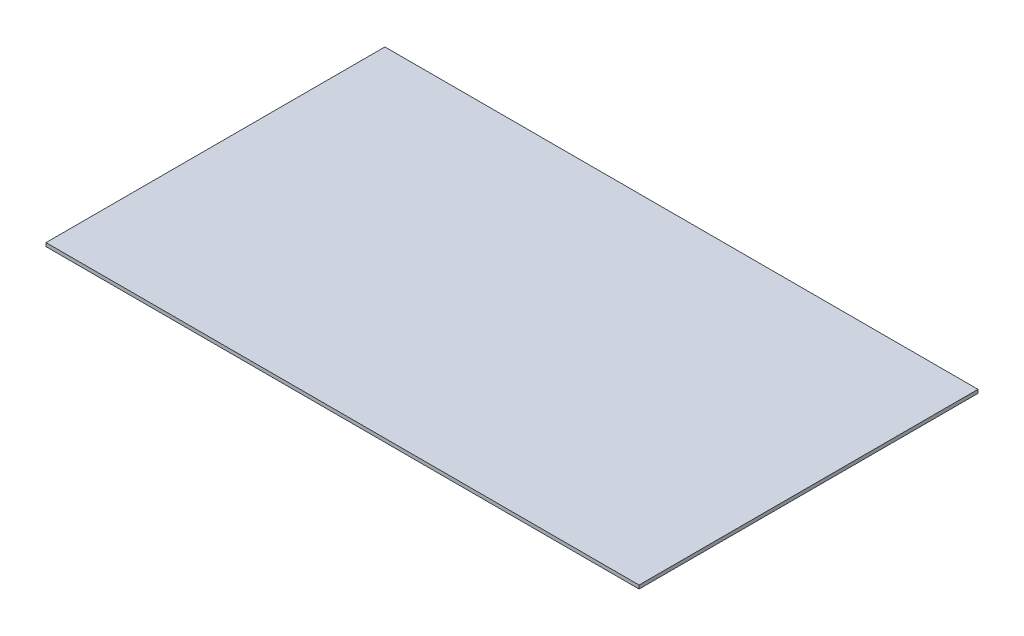
ISO-10303-21;
HEADER;
FILE_DESCRIPTION(('STEP AP214'),'2;1');
FILE_NAME('part.step','',(''),(''),'','','');
FILE_SCHEMA(('AUTOMOTIVE_DESIGN { 1 0 10303 214 1 1 1 1 }'));
ENDSEC;
DATA;
#1=APPLICATION_CONTEXT('core data for automotive mechanical design processes');
#2=APPLICATION_PROTOCOL_DEFINITION('international standard','automotive_design',2000,#1);
#3=PRODUCT_CONTEXT('',#1,'mechanical');
#4=PRODUCT('Part','Part','',(#3));
#5=PRODUCT_RELATED_PRODUCT_CATEGORY('part','',(#4));
#6=PRODUCT_DEFINITION_FORMATION('','',#4);
#7=PRODUCT_DEFINITION_CONTEXT('part definition',#1,'design');
#8=PRODUCT_DEFINITION('design','',#6,#7);
#9=PRODUCT_DEFINITION_SHAPE('','',#8);
#10=(LENGTH_UNIT() NAMED_UNIT(*) SI_UNIT(.MILLI.,.METRE.));
#11=(NAMED_UNIT(*) PLANE_ANGLE_UNIT() SI_UNIT($,.RADIAN.));
#12=(NAMED_UNIT(*) SI_UNIT($,.STERADIAN.) SOLID_ANGLE_UNIT());
#13=UNCERTAINTY_MEASURE_WITH_UNIT(LENGTH_MEASURE(1.E-05),#10,'distance_accuracy_value','');
#14=(GEOMETRIC_REPRESENTATION_CONTEXT(3) GLOBAL_UNCERTAINTY_ASSIGNED_CONTEXT((#13)) GLOBAL_UNIT_ASSIGNED_CONTEXT((#10,
#11,#12)) REPRESENTATION_CONTEXT('',''));
#15=CARTESIAN_POINT('',(0.,0.,0.));
#16=DIRECTION('',(0.,0.,1.));
#17=DIRECTION('',(1.,0.,0.));
#18=AXIS2_PLACEMENT_3D('',#15,#16,#17);
#19=CARTESIAN_POINT('',(-1852.94392662048,-3.175,0.));
#20=DIRECTION('',(0.,0.,-1.));
#21=DIRECTION('',(-1.,0.,0.));
#22=AXIS2_PLACEMENT_3D('',#19,#20,#21);
#23=PLANE('',#22);
#24=DIRECTION('',(-1.,0.,0.));
#25=VECTOR('',#24,1.);
#26=CARTESIAN_POINT('',(-1852.94392662048,0.,0.));
#27=LINE('',#26,#25);
#28=CARTESIAN_POINT('',(-1586.24392662049,0.,0.));
#29=VERTEX_POINT('',#28);
#30=CARTESIAN_POINT('',(-2119.64392662049,0.,0.));
#31=VERTEX_POINT('',#30);
#32=EDGE_CURVE('E99',#29,#31,#27,.T.);
#33=ORIENTED_EDGE('',*,*,#32,.F.);
#34=DIRECTION('',(0.,1.,0.));
#35=VECTOR('',#34,1.);
#36=CARTESIAN_POINT('',(-1586.24392662049,-3.175,0.));
#37=LINE('',#36,#35);
#38=CARTESIAN_POINT('',(-1586.24392662049,-3.175,0.));
#39=VERTEX_POINT('',#38);
#40=EDGE_CURVE('E9',#39,#29,#37,.T.);
#41=ORIENTED_EDGE('',*,*,#40,.F.);
#42=DIRECTION('',(-1.,0.,0.));
#43=VECTOR('',#42,1.);
#44=CARTESIAN_POINT('',(-1852.94392662048,-3.175,0.));
#45=LINE('',#44,#43);
#46=CARTESIAN_POINT('',(-2119.64392662049,-3.175,0.));
#47=VERTEX_POINT('',#46);
#48=EDGE_CURVE('E77',#39,#47,#45,.T.);
#49=ORIENTED_EDGE('',*,*,#48,.T.);
#50=DIRECTION('',(0.,1.,0.));
#51=VECTOR('',#50,1.);
#52=CARTESIAN_POINT('',(-2119.64392662049,-3.175,0.));
#53=LINE('',#52,#51);
#54=EDGE_CURVE('E36',#47,#31,#53,.T.);
#55=ORIENTED_EDGE('',*,*,#54,.T.);
#56=EDGE_LOOP('',(#33,#41,#49,#55));
#57=FACE_BOUND('',#56,.T.);
#58=ADVANCED_FACE('F14',(#57),#23,.T.);
#59=CARTESIAN_POINT('',(-1586.24392662049,-3.175,152.4));
#60=DIRECTION('',(-1.,0.,0.));
#61=DIRECTION('',(0.,0.,1.));
#62=AXIS2_PLACEMENT_3D('',#59,#60,#61);
#63=PLANE('',#62);
#64=DIRECTION('',(0.,0.,1.));
#65=VECTOR('',#64,1.);
#66=CARTESIAN_POINT('',(-1586.24392662049,0.,152.4));
#67=LINE('',#66,#65);
#68=CARTESIAN_POINT('',(-1586.24392662049,0.,304.8));
#69=VERTEX_POINT('',#68);
#70=EDGE_CURVE('E84',#29,#69,#67,.T.);
#71=ORIENTED_EDGE('',*,*,#70,.T.);
#72=DIRECTION('',(0.,1.,0.));
#73=VECTOR('',#72,1.);
#74=CARTESIAN_POINT('',(-1586.24392662049,-3.175,304.8));
#75=LINE('',#74,#73);
#76=CARTESIAN_POINT('',(-1586.24392662049,-3.175,304.8));
#77=VERTEX_POINT('',#76);
#78=EDGE_CURVE('E23',#77,#69,#75,.T.);
#79=ORIENTED_EDGE('',*,*,#78,.F.);
#80=DIRECTION('',(0.,0.,1.));
#81=VECTOR('',#80,1.);
#82=CARTESIAN_POINT('',(-1586.24392662049,-3.175,152.4));
#83=LINE('',#82,#81);
#84=EDGE_CURVE('E71',#39,#77,#83,.T.);
#85=ORIENTED_EDGE('',*,*,#84,.F.);
#86=ORIENTED_EDGE('',*,*,#40,.T.);
#87=EDGE_LOOP('',(#71,#79,#85,#86));
#88=FACE_BOUND('',#87,.T.);
#89=ADVANCED_FACE('F82',(#88),#63,.F.);
#90=CARTESIAN_POINT('',(-1852.94392662048,-3.175,304.8));
#91=DIRECTION('',(0.,0.,-1.));
#92=DIRECTION('',(-1.,0.,0.));
#93=AXIS2_PLACEMENT_3D('',#90,#91,#92);
#94=PLANE('',#93);
#95=DIRECTION('',(-1.,0.,0.));
#96=VECTOR('',#95,1.);
#97=CARTESIAN_POINT('',(-1852.94392662048,0.,304.8));
#98=LINE('',#97,#96);
#99=CARTESIAN_POINT('',(-2119.64392662049,0.,304.8));
#100=VERTEX_POINT('',#99);
#101=EDGE_CURVE('E103',#69,#100,#98,.T.);
#102=ORIENTED_EDGE('',*,*,#101,.T.);
#103=DIRECTION('',(0.,1.,0.));
#104=VECTOR('',#103,1.);
#105=CARTESIAN_POINT('',(-2119.64392662049,-3.175,304.8));
#106=LINE('',#105,#104);
#107=CARTESIAN_POINT('',(-2119.64392662049,-3.175,304.8));
#108=VERTEX_POINT('',#107);
#109=EDGE_CURVE('E55',#108,#100,#106,.T.);
#110=ORIENTED_EDGE('',*,*,#109,.F.);
#111=DIRECTION('',(-1.,0.,0.));
#112=VECTOR('',#111,1.);
#113=CARTESIAN_POINT('',(-1852.94392662048,-3.175,304.8));
#114=LINE('',#113,#112);
#115=EDGE_CURVE('E76',#77,#108,#114,.T.);
#116=ORIENTED_EDGE('',*,*,#115,.F.);
#117=ORIENTED_EDGE('',*,*,#78,.T.);
#118=EDGE_LOOP('',(#102,#110,#116,#117));
#119=FACE_BOUND('',#118,.T.);
#120=ADVANCED_FACE('F88',(#119),#94,.F.);
#121=CARTESIAN_POINT('',(-2119.64392662049,-3.175,152.4));
#122=DIRECTION('',(-1.,0.,0.));
#123=DIRECTION('',(0.,0.,1.));
#124=AXIS2_PLACEMENT_3D('',#121,#122,#123);
#125=PLANE('',#124);
#126=DIRECTION('',(0.,0.,1.));
#127=VECTOR('',#126,1.);
#128=CARTESIAN_POINT('',(-2119.64392662049,0.,152.4));
#129=LINE('',#128,#127);
#130=EDGE_CURVE('E105',#31,#100,#129,.T.);
#131=ORIENTED_EDGE('',*,*,#130,.F.);
#132=ORIENTED_EDGE('',*,*,#54,.F.);
#133=DIRECTION('',(0.,0.,1.));
#134=VECTOR('',#133,1.);
#135=CARTESIAN_POINT('',(-2119.64392662049,-3.175,152.4));
#136=LINE('',#135,#134);
#137=EDGE_CURVE('E90',#47,#108,#136,.T.);
#138=ORIENTED_EDGE('',*,*,#137,.T.);
#139=ORIENTED_EDGE('',*,*,#109,.T.);
#140=EDGE_LOOP('',(#131,#132,#138,#139));
#141=FACE_BOUND('',#140,.T.);
#142=ADVANCED_FACE('F120',(#141),#125,.T.);
#143=CARTESIAN_POINT('',(-1852.94392662048,-3.175,152.4));
#144=DIRECTION('',(0.,-1.,0.));
#145=DIRECTION('',(1.,0.,0.));
#146=AXIS2_PLACEMENT_3D('',#143,#144,#145);
#147=PLANE('',#146);
#148=ORIENTED_EDGE('',*,*,#48,.F.);
#149=ORIENTED_EDGE('',*,*,#84,.T.);
#150=ORIENTED_EDGE('',*,*,#115,.T.);
#151=ORIENTED_EDGE('',*,*,#137,.F.);
#152=EDGE_LOOP('',(#148,#149,#150,#151));
#153=FACE_BOUND('',#152,.T.);
#154=ADVANCED_FACE('F73',(#153),#147,.T.);
#155=CARTESIAN_POINT('',(-1852.94392662048,0.,152.4));
#156=DIRECTION('',(0.,-1.,0.));
#157=DIRECTION('',(1.,0.,0.));
#158=AXIS2_PLACEMENT_3D('',#155,#156,#157);
#159=PLANE('',#158);
#160=ORIENTED_EDGE('',*,*,#32,.T.);
#161=ORIENTED_EDGE('',*,*,#130,.T.);
#162=ORIENTED_EDGE('',*,*,#101,.F.);
#163=ORIENTED_EDGE('',*,*,#70,.F.);
#164=EDGE_LOOP('',(#160,#161,#162,#163));
#165=FACE_BOUND('',#164,.T.);
#166=ADVANCED_FACE('F128',(#165),#159,.F.);
#167=CLOSED_SHELL('',(#58,#89,#120,#142,#154,#166));
#168=MANIFOLD_SOLID_BREP('B1',#167);
#169=ADVANCED_BREP_SHAPE_REPRESENTATION('',(#18,#168),#14);
#170=SHAPE_DEFINITION_REPRESENTATION(#9,#169);
ENDSEC;
END-ISO-10303-21;
